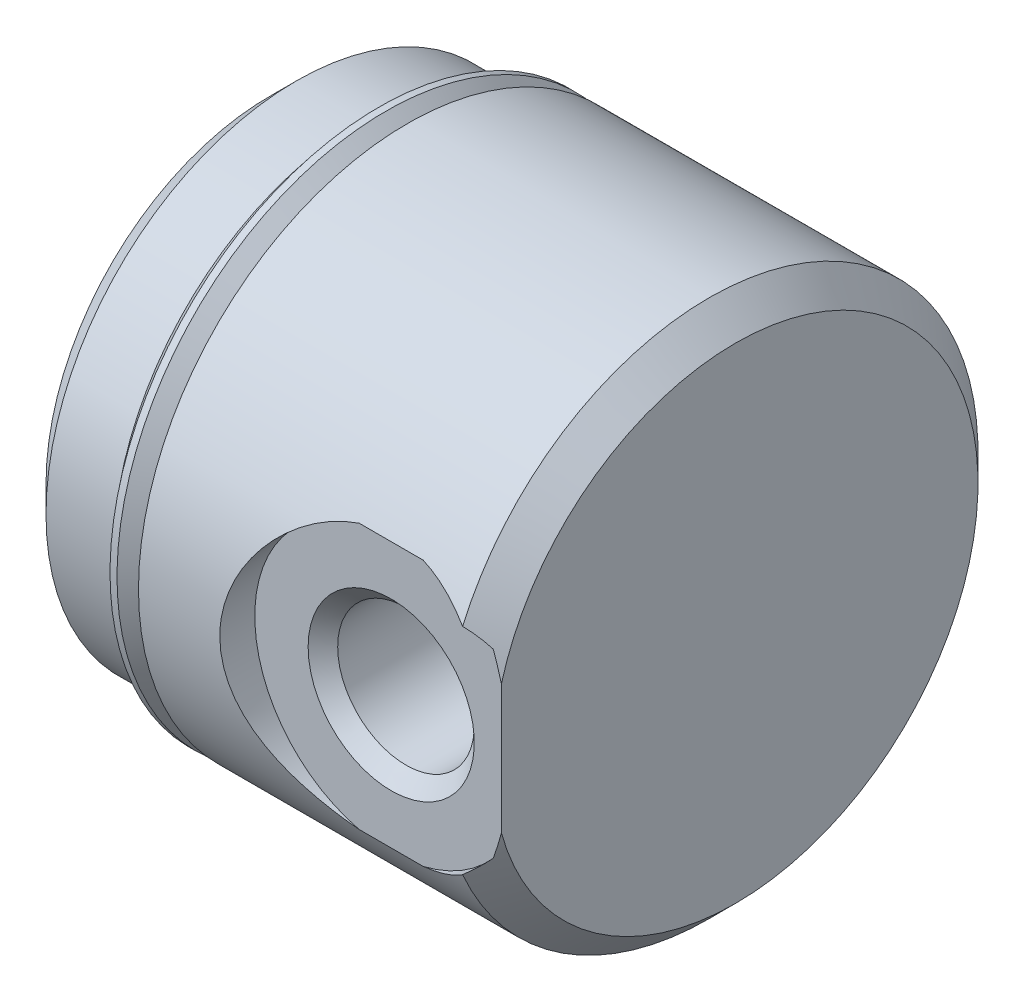
ISO-10303-21;
HEADER;
FILE_DESCRIPTION(('STEP AP214'),'2;1');
FILE_NAME('part.step','',(''),(''),'','','');
FILE_SCHEMA(('AUTOMOTIVE_DESIGN { 1 0 10303 214 1 1 1 1 }'));
ENDSEC;
DATA;
#1=APPLICATION_CONTEXT('core data for automotive mechanical design processes');
#2=APPLICATION_PROTOCOL_DEFINITION('international standard','automotive_design',2000,#1);
#3=PRODUCT_CONTEXT('',#1,'mechanical');
#4=PRODUCT('Part','Part','',(#3));
#5=PRODUCT_RELATED_PRODUCT_CATEGORY('part','',(#4));
#6=PRODUCT_DEFINITION_FORMATION('','',#4);
#7=PRODUCT_DEFINITION_CONTEXT('part definition',#1,'design');
#8=PRODUCT_DEFINITION('design','',#6,#7);
#9=PRODUCT_DEFINITION_SHAPE('','',#8);
#10=(LENGTH_UNIT() NAMED_UNIT(*) SI_UNIT(.MILLI.,.METRE.));
#11=(NAMED_UNIT(*) PLANE_ANGLE_UNIT() SI_UNIT($,.RADIAN.));
#12=(NAMED_UNIT(*) SI_UNIT($,.STERADIAN.) SOLID_ANGLE_UNIT());
#13=UNCERTAINTY_MEASURE_WITH_UNIT(LENGTH_MEASURE(1.E-05),#10,'distance_accuracy_value','');
#14=(GEOMETRIC_REPRESENTATION_CONTEXT(3) GLOBAL_UNCERTAINTY_ASSIGNED_CONTEXT((#13)) GLOBAL_UNIT_ASSIGNED_CONTEXT((#10,
#11,#12)) REPRESENTATION_CONTEXT('',''));
#15=CARTESIAN_POINT('',(0.,0.,0.));
#16=DIRECTION('',(0.,0.,1.));
#17=DIRECTION('',(1.,0.,0.));
#18=AXIS2_PLACEMENT_3D('',#15,#16,#17);
#19=CARTESIAN_POINT('',(13.5128,0.,0.));
#20=DIRECTION('',(-1.,0.,0.));
#21=DIRECTION('',(0.,0.,1.));
#22=AXIS2_PLACEMENT_3D('',#19,#20,#21);
#23=CYLINDRICAL_SURFACE('',#22,6.63575);
#24=CARTESIAN_POINT('',(3.3528,0.,0.));
#25=DIRECTION('',(-1.,0.,0.));
#26=DIRECTION('',(0.,0.,1.));
#27=AXIS2_PLACEMENT_3D('',#24,#25,#26);
#28=CIRCLE('',#27,6.63575);
#29=CARTESIAN_POINT('',(3.3528,0.,6.63575));
#30=VERTEX_POINT('',#29);
#31=EDGE_CURVE('E217',#30,#30,#28,.T.);
#32=ORIENTED_EDGE('',*,*,#31,.F.);
#33=EDGE_LOOP('',(#32));
#34=FACE_BOUND('',#33,.T.);
#35=CARTESIAN_POINT('',(3.67030000000005,0.,0.));
#36=DIRECTION('',(1.,0.,0.));
#37=DIRECTION('',(0.,1.,0.));
#38=AXIS2_PLACEMENT_3D('',#35,#36,#37);
#39=CIRCLE('',#38,6.63575);
#40=CARTESIAN_POINT('',(3.67030000000002,6.63575000000002,0.));
#41=VERTEX_POINT('',#40);
#42=EDGE_CURVE('E11',#41,#41,#39,.T.);
#43=ORIENTED_EDGE('',*,*,#42,.F.);
#44=EDGE_LOOP('',(#43));
#45=FACE_BOUND('',#44,.T.);
#46=ADVANCED_FACE('F32',(#34,#45),#23,.T.);
#47=CARTESIAN_POINT('',(13.5128,0.,0.));
#48=DIRECTION('',(-1.,0.,0.));
#49=DIRECTION('',(0.,0.,1.));
#50=AXIS2_PLACEMENT_3D('',#47,#48,#49);
#51=CYLINDRICAL_SURFACE('',#50,7.8105);
#52=CARTESIAN_POINT('',(3.9878,0.,0.));
#53=DIRECTION('',(-1.,0.,0.));
#54=DIRECTION('',(0.,0.,1.));
#55=AXIS2_PLACEMENT_3D('',#52,#53,#54);
#56=CIRCLE('',#55,7.8105);
#57=CARTESIAN_POINT('',(3.9878,0.,7.8105));
#58=VERTEX_POINT('',#57);
#59=EDGE_CURVE('E222',#58,#58,#56,.T.);
#60=ORIENTED_EDGE('',*,*,#59,.F.);
#61=EDGE_LOOP('',(#60));
#62=FACE_BOUND('',#61,.T.);
#63=CARTESIAN_POINT('',(9.38399612236914,3.85210072557819,6.7945));
#64=CARTESIAN_POINT('',(9.27525514945077,3.82589500564141,6.80934433204708));
#65=CARTESIAN_POINT('',(9.16802096495672,3.79517500586059,6.82657399668449));
#66=CARTESIAN_POINT('',(8.95724584367017,3.72511680182272,6.86506038601814));
#67=CARTESIAN_POINT('',(8.8537019230518,3.68578575285989,6.88631376526359));
#68=CARTESIAN_POINT('',(8.55020870658089,3.55577888639684,6.95484713687291));
#69=CARTESIAN_POINT('',(8.3564755421578,3.45286266206164,7.00703729481279));
#70=CARTESIAN_POINT('',(7.99051036112021,3.21817634438967,7.11786553311782));
#71=CARTESIAN_POINT('',(7.81822022256684,3.08648703832435,7.17648533571344));
#72=CARTESIAN_POINT('',(7.4971811190607,2.79677234095304,7.29427484256322));
#73=CARTESIAN_POINT('',(7.34846298374265,2.63871300579141,7.35344516154359));
#74=CARTESIAN_POINT('',(7.06940154883617,2.28841557588023,7.47015661481015));
#75=CARTESIAN_POINT('',(6.94082853392618,2.09464302317266,7.52735477020865));
#76=CARTESIAN_POINT('',(6.71863925116721,1.68511919200368,7.62946016123117));
#77=CARTESIAN_POINT('',(6.62498895097854,1.46938957321628,7.67437935130223));
#78=CARTESIAN_POINT('',(6.48499839115904,1.04670163284467,7.74267421743849));
#79=CARTESIAN_POINT('',(6.4345871592955,0.841388849692399,7.76787617373968));
#80=CARTESIAN_POINT('',(6.36709753469923,0.4240446774056,7.80178403706623));
#81=CARTESIAN_POINT('',(6.35000213276855,0.212016772858684,7.81049836168719));
#82=CARTESIAN_POINT('',(6.34999790509193,-0.208253092440596,7.8105016092298));
#83=CARTESIAN_POINT('',(6.36648759312599,-0.416495444900189,7.80209711836994));
#84=CARTESIAN_POINT('',(6.43161549719737,-0.826593665158206,7.76936300856744));
#85=CARTESIAN_POINT('',(6.48026119956296,-1.02844803428297,7.7450296812023));
#86=CARTESIAN_POINT('',(6.60730932530864,-1.41953626393276,7.68296480855789));
#87=CARTESIAN_POINT('',(6.68561430159466,-1.60880909321737,7.645277165452));
#88=CARTESIAN_POINT('',(6.86916132351943,-1.97130408916965,7.55993347529357));
#89=CARTESIAN_POINT('',(6.97440994060004,-2.14452232613126,7.51227499691478));
#90=CARTESIAN_POINT('',(7.21620525938159,-2.48190984333818,7.40790858770927));
#91=CARTESIAN_POINT('',(7.35427936201733,-2.64486639030063,7.35082425979541));
#92=CARTESIAN_POINT('',(7.65450312726616,-2.94644852490168,7.23522519139544));
#93=CARTESIAN_POINT('',(7.81667373068981,-3.08505271842146,7.17670924409722));
#94=CARTESIAN_POINT('',(8.16248595465623,-3.3352651062674,7.06390731868926));
#95=CARTESIAN_POINT('',(8.34615076465179,-3.44684373778794,7.00962601637755));
#96=CARTESIAN_POINT('',(8.63462650467648,-3.59127493866339,6.93610629540564));
#97=CARTESIAN_POINT('',(8.73286077067896,-3.63556844811676,6.91293281761722));
#98=CARTESIAN_POINT('',(8.93322584452171,-3.71619801837318,6.86992504364546));
#99=CARTESIAN_POINT('',(9.03535390798847,-3.75253956633276,6.85008844708623));
#100=CARTESIAN_POINT('',(9.17945389360375,-3.79721428881743,6.82534082601764));
#101=CARTESIAN_POINT('',(9.22006449116651,-3.80909600866532,6.81871427962771));
#102=CARTESIAN_POINT('',(9.30171232861858,-3.83156813434324,6.80611204807017));
#103=CARTESIAN_POINT('',(9.34274927489272,-3.84215937221748,6.80013594379516));
#104=CARTESIAN_POINT('',(9.38399612236914,-3.85210072557819,6.7945));
#105=B_SPLINE_CURVE_WITH_KNOTS('',3,(#63,#64,#65,#66,#67,#68,#69,#70,#71,#72,#73,#74,#75,#76,
#77,#78,#79,#80,#81,#82,#83,#84,#85,#86,#87,#88,#89,#90,#91,#92,#93,#94,#95,#96,#97,#98,#99,
#100,#101,#102,#103,#104),.UNSPECIFIED.,.F.,.F.,(4,2,2,2,2,2,2,2,2,2,2,2,2,2,2,2,2,2,2,2,4),(0.,
0.338222818675509,0.676165652849875,1.34921264078913,2.02039363276877,2.69244533968194,
3.40724108890215,4.12133843480017,4.7568840992762,5.3921052046171,6.01604998873543,
6.64014008630427,7.26219724397962,7.8844062635915,8.54490302049851,9.20597716914357,
9.86777122242373,10.1981171851282,10.5282344725933,10.6567002766156,10.7850828084272),.UNSPECIFIED.);
#106=CARTESIAN_POINT('',(9.38399612236914,3.85210072557819,6.7945));
#107=VERTEX_POINT('',#106);
#108=CARTESIAN_POINT('',(9.38399612236914,-3.85210072557819,6.7945));
#109=VERTEX_POINT('',#108);
#110=EDGE_CURVE('E174',#107,#109,#105,.T.);
#111=ORIENTED_EDGE('',*,*,#110,.F.);
#112=DIRECTION('',(-1.,0.,0.));
#113=VECTOR('',#112,1.);
#114=CARTESIAN_POINT('',(13.5128,3.85210072557819,6.7945));
#115=LINE('',#114,#113);
#116=CARTESIAN_POINT('',(11.2408038776309,3.85210072557819,6.7945));
#117=VERTEX_POINT('',#116);
#118=EDGE_CURVE('E261',#117,#107,#115,.T.);
#119=ORIENTED_EDGE('',*,*,#118,.F.);
#120=CARTESIAN_POINT('',(12.7508,3.12327059346449,7.15884704753496));
#121=CARTESIAN_POINT('',(12.6655559368567,3.1898241455409,7.12981237945193));
#122=CARTESIAN_POINT('',(12.577488456607,3.25296111612175,7.10116031336817));
#123=CARTESIAN_POINT('',(12.3960253027595,3.37207803017898,7.04537627065184));
#124=CARTESIAN_POINT('',(12.302623355752,3.42804928517144,7.01824616137133));
#125=CARTESIAN_POINT('',(12.1128109754522,3.53137242590324,6.96682057227383));
#126=CARTESIAN_POINT('',(12.01648964568,3.57886610492564,6.94248152080266));
#127=CARTESIAN_POINT('',(11.8197706894276,3.66606160853936,6.89683433759524));
#128=CARTESIAN_POINT('',(11.7193766316544,3.70577008418982,6.87552362301046));
#129=CARTESIAN_POINT('',(11.5558463074784,3.76280245035719,6.84440084379513));
#130=CARTESIAN_POINT('',(11.4938343188973,3.78273457572507,6.83339444351767));
#131=CARTESIAN_POINT('',(11.3683217162896,3.81967906487981,6.81281190797561));
#132=CARTESIAN_POINT('',(11.3048146525249,3.83667422140811,6.80324424179991));
#133=CARTESIAN_POINT('',(11.2408038776309,3.85210072557819,6.7945));
#134=B_SPLINE_CURVE_WITH_KNOTS('',3,(#120,#121,#122,#123,#124,#125,#126,#127,#128,#129,#130,
#131,#132,#133),.UNSPECIFIED.,.F.,.F.,(4,2,2,2,2,2,4),(0.,0.335875743787151,0.672154958236014,
1.00213628499122,1.33183446161207,1.52992691212799,1.72914326559982),.UNSPECIFIED.);
#135=CARTESIAN_POINT('',(12.7508,3.12327059346449,7.15884704753496));
#136=VERTEX_POINT('',#135);
#137=EDGE_CURVE('E170',#136,#117,#134,.T.);
#138=ORIENTED_EDGE('',*,*,#137,.F.);
#139=CARTESIAN_POINT('',(12.7508,0.,0.));
#140=DIRECTION('',(-1.,0.,0.));
#141=DIRECTION('',(0.,0.,1.));
#142=AXIS2_PLACEMENT_3D('',#139,#140,#141);
#143=CIRCLE('',#142,7.8105);
#144=CARTESIAN_POINT('',(12.7508,-3.12327059346449,7.15884704753496));
#145=VERTEX_POINT('',#144);
#146=EDGE_CURVE('E225',#136,#145,#143,.T.);
#147=ORIENTED_EDGE('',*,*,#146,.T.);
#148=CARTESIAN_POINT('',(11.2408038776309,-3.85210072557819,6.7945));
#149=CARTESIAN_POINT('',(11.3487874661514,-3.82608734118409,6.80923597428489));
#150=CARTESIAN_POINT('',(11.4553272931661,-3.7955949609063,6.82633875035155));
#151=CARTESIAN_POINT('',(11.6648263189775,-3.72608473219303,6.86453323045579));
#152=CARTESIAN_POINT('',(11.7677864482778,-3.68706911877762,6.88562388856926));
#153=CARTESIAN_POINT('',(11.967740110973,-3.60167827285247,6.93066373338396));
#154=CARTESIAN_POINT('',(12.0648061796481,-3.55544250400555,6.95455696361609));
#155=CARTESIAN_POINT('',(12.2543575094363,-3.4555582788781,7.00472342703105));
#156=CARTESIAN_POINT('',(12.346844503417,-3.40191265630321,7.03099574907564));
#157=CARTESIAN_POINT('',(12.4908755223305,-3.31043192739124,7.07434755482647));
#158=CARTESIAN_POINT('',(12.5440178501033,-3.27484029422275,7.09090741560835));
#159=CARTESIAN_POINT('',(12.6487074330667,-3.20100048056863,7.12454640451288));
#160=CARTESIAN_POINT('',(12.7002446852178,-3.16273916066868,7.14162782854875));
#161=CARTESIAN_POINT('',(12.7508,-3.12327059346449,7.15884704753496));
#162=B_SPLINE_CURVE_WITH_KNOTS('',3,(#148,#149,#150,#151,#152,#153,#154,#155,#156,#157,#158,
#159,#160,#161),.UNSPECIFIED.,.F.,.F.,(4,2,2,2,2,2,4),(0.,0.33595843839208,0.671828885004199,
1.00187083479376,1.33178691629107,1.52992689818495,1.72912219497278),.UNSPECIFIED.);
#163=CARTESIAN_POINT('',(11.2408038776309,-3.85210072557819,6.7945));
#164=VERTEX_POINT('',#163);
#165=EDGE_CURVE('E164',#164,#145,#162,.T.);
#166=ORIENTED_EDGE('',*,*,#165,.F.);
#167=DIRECTION('',(-1.,0.,0.));
#168=VECTOR('',#167,1.);
#169=CARTESIAN_POINT('',(13.5128,-3.85210072557819,6.7945));
#170=LINE('',#169,#168);
#171=EDGE_CURVE('E268',#109,#164,#170,.F.);
#172=ORIENTED_EDGE('',*,*,#171,.F.);
#173=EDGE_LOOP('',(#111,#119,#138,#147,#166,#172));
#174=FACE_BOUND('',#173,.T.);
#175=ADVANCED_FACE('F179',(#62,#174),#51,.T.);
#176=CARTESIAN_POINT('',(13.5128,0.,0.));
#177=DIRECTION('',(-1.,0.,0.));
#178=DIRECTION('',(0.,0.,1.));
#179=AXIS2_PLACEMENT_3D('',#176,#177,#178);
#180=CONICAL_SURFACE('',#179,7.0485,0.785398163397448);
#181=CARTESIAN_POINT('',(9.49140746056933,-8.7394101966061,6.7945));
#182=CARTESIAN_POINT('',(9.64426579725967,-8.54575700662644,6.7945));
#183=CARTESIAN_POINT('',(9.79598137394143,-8.35119045289017,6.7945));
#184=CARTESIAN_POINT('',(10.0966409028078,-7.9598804254788,6.7945));
#185=CARTESIAN_POINT('',(10.2455844132447,-7.76313661267479,6.7945));
#186=CARTESIAN_POINT('',(10.5408614306149,-7.36624688277227,6.7945));
#187=CARTESIAN_POINT('',(10.6871792688678,-7.16608927887687,6.7945));
#188=CARTESIAN_POINT('',(10.9757819818662,-6.76289558199411,6.7945));
#189=CARTESIAN_POINT('',(11.1180670497523,-6.55985962755991,6.7945));
#190=CARTESIAN_POINT('',(11.4044051028073,-6.14068708368496,6.7945));
#191=CARTESIAN_POINT('',(11.5482196702436,-5.92438703356951,6.7945));
#192=CARTESIAN_POINT('',(11.8292052349774,-5.4874628667435,6.7945));
#193=CARTESIAN_POINT('',(11.9663755397359,-5.26683830263595,6.7945));
#194=CARTESIAN_POINT('',(12.2321205727388,-4.82099454058223,6.7945));
#195=CARTESIAN_POINT('',(12.3607106557173,-4.59578454589868,6.7945));
#196=CARTESIAN_POINT('',(12.6073393962508,-4.13969271797501,6.7945));
#197=CARTESIAN_POINT('',(12.7253810470873,-3.90881251760282,6.7945));
#198=CARTESIAN_POINT('',(12.9371220333846,-3.46371027077012,6.7945));
#199=CARTESIAN_POINT('',(13.0320738511881,-3.25008835450491,6.7945));
#200=CARTESIAN_POINT('',(13.2085293963946,-2.81727568340665,6.7945));
#201=CARTESIAN_POINT('',(13.2900318624374,-2.59808440846811,6.7945));
#202=CARTESIAN_POINT('',(13.4357616210469,-2.15661042486929,6.7945));
#203=CARTESIAN_POINT('',(13.5001675962105,-1.93438748873129,6.7945));
#204=CARTESIAN_POINT('',(13.6097759823049,-1.48520590811597,6.7945));
#205=CARTESIAN_POINT('',(13.6549806063305,-1.25824781256518,6.7945));
#206=CARTESIAN_POINT('',(13.7241449876086,-0.796547614716598,6.7945));
#207=CARTESIAN_POINT('',(13.7476760881768,-0.561739898219707,6.7945));
#208=CARTESIAN_POINT('',(13.7702581670218,-0.0909537779366904,6.7945));
#209=CARTESIAN_POINT('',(13.7693120025898,0.145024485993293,6.7945));
#210=CARTESIAN_POINT('',(13.742985746537,0.616163272173993,6.7945));
#211=CARTESIAN_POINT('',(13.7175462370887,0.851320409945158,6.7945));
#212=CARTESIAN_POINT('',(13.6439837210982,1.31804072771941,6.7945));
#213=CARTESIAN_POINT('',(13.595854580662,1.54960291837184,6.7945));
#214=CARTESIAN_POINT('',(13.464002121112,2.07027394210681,6.7945));
#215=CARTESIAN_POINT('',(13.3741460328673,2.35781582332683,6.7945));
#216=CARTESIAN_POINT('',(13.1691787635715,2.92369387323482,6.7945));
#217=CARTESIAN_POINT('',(13.0540535940133,3.20202484433047,6.7945));
#218=CARTESIAN_POINT('',(12.8035779245321,3.75199167165985,6.7945));
#219=CARTESIAN_POINT('',(12.6680734656556,4.02355644203065,6.7945));
#220=CARTESIAN_POINT('',(12.3823369857443,4.55865515554981,6.7945));
#221=CARTESIAN_POINT('',(12.2321080764981,4.82219078017014,6.7945));
#222=CARTESIAN_POINT('',(11.8819470844149,5.40680573244951,6.7945));
#223=CARTESIAN_POINT('',(11.6789065439073,5.72601168566491,6.7945));
#224=CARTESIAN_POINT('',(11.2602256462692,6.35610652786929,6.7945));
#225=CARTESIAN_POINT('',(11.0445813596588,6.66699277850116,6.7945));
#226=CARTESIAN_POINT('',(10.609518806143,7.27436997752772,6.7945));
#227=CARTESIAN_POINT('',(10.3903305676446,7.5710264323084,6.7945));
#228=CARTESIAN_POINT('',(10.0565997126367,8.01203315805542,6.7945));
#229=CARTESIAN_POINT('',(9.94458282461457,8.15830752655089,6.7945));
#230=CARTESIAN_POINT('',(9.71906341788757,8.44969582633714,6.7945));
#231=CARTESIAN_POINT('',(9.6055609703792,8.59480981270698,6.7945));
#232=CARTESIAN_POINT('',(9.49140746056933,8.7394101966061,6.7945));
#233=B_SPLINE_CURVE_WITH_KNOTS('',3,(#181,#182,#183,#184,#185,#186,#187,#188,#189,#190,#191,
#192,#193,#194,#195,#196,#197,#198,#199,#200,#201,#202,#203,#204,#205,#206,#207,#208,#209,#210,
#211,#212,#213,#214,#215,#216,#217,#218,#219,#220,#221,#222,#223,#224,#225,#226,#227,#228,#229,
#230,#231,#232),.UNSPECIFIED.,.F.,.F.,(4,2,2,2,2,2,2,2,2,2,2,2,2,2,2,2,2,2,2,2,2,2,2,2,2,4),(0.,
0.740147440544245,1.48041183582862,2.22417603592427,2.96790455471248,3.74704634345077,
4.52626916904978,5.30405790904193,6.08162523385951,6.78257788043754,7.48359622920699,
8.17697046937258,8.87026477144101,9.57699370060748,10.2836401319507,10.9920051306815,
11.7005617380673,12.6027504407288,13.5054398440798,14.4153274088645,15.3250230956728,
16.4595215698103,17.5943756539681,18.7007881879111,19.2534976174719,19.8061806543341),.UNSPECIFIED.);
#234=CARTESIAN_POINT('',(13.5128,1.87513252864964,6.7945));
#235=VERTEX_POINT('',#234);
#236=CARTESIAN_POINT('',(13.2751529346136,2.63110410444708,6.7945));
#237=VERTEX_POINT('',#236);
#238=EDGE_CURVE('E111',#235,#237,#233,.T.);
#239=ORIENTED_EDGE('',*,*,#238,.F.);
#240=CARTESIAN_POINT('',(13.5128,0.,0.));
#241=DIRECTION('',(-1.,0.,0.));
#242=DIRECTION('',(0.,0.,1.));
#243=AXIS2_PLACEMENT_3D('',#240,#241,#242);
#244=CIRCLE('',#243,7.0485);
#245=CARTESIAN_POINT('',(13.5128,-1.87513252864964,6.7945));
#246=VERTEX_POINT('',#245);
#247=EDGE_CURVE('E228',#235,#246,#244,.T.);
#248=ORIENTED_EDGE('',*,*,#247,.T.);
#249=CARTESIAN_POINT('',(13.2751529346136,-2.63110410444708,6.7945));
#250=VERTEX_POINT('',#249);
#251=EDGE_CURVE('E47',#250,#246,#233,.T.);
#252=ORIENTED_EDGE('',*,*,#251,.F.);
#253=CARTESIAN_POINT('',(12.6744,-3.18144145946456,7.21675978885261));
#254=CARTESIAN_POINT('',(12.7428462942749,-3.13063101730477,7.16433883739875));
#255=CARTESIAN_POINT('',(12.8106286002932,-3.07687381670484,7.11384472463599));
#256=CARTESIAN_POINT('',(12.9437902999926,-2.96377725375633,7.0173804234194));
#257=CARTESIAN_POINT('',(13.0091819939163,-2.90447459819277,6.97138410832151));
#258=CARTESIAN_POINT('',(13.1373601067734,-2.77996198064994,6.8839214095247));
#259=CARTESIAN_POINT('',(13.2001462436358,-2.71475138151159,6.84245551548834));
#260=CARTESIAN_POINT('',(13.3227431146446,-2.5781681959087,6.76403383783796));
#261=CARTESIAN_POINT('',(13.3825328244488,-2.50675967916862,6.7271078293995));
#262=CARTESIAN_POINT('',(13.4402439490976,-2.43253077885839,6.6927));
#263=B_SPLINE_CURVE_WITH_KNOTS('',3,(#253,#254,#255,#256,#257,#258,#259,#260,#261,#262),
.UNSPECIFIED.,.F.,.F.,(4,2,2,2,4),(0.,0.300202802782513,0.598542861090956,0.896915133125371,
1.19715028692185),.UNSPECIFIED.);
#264=EDGE_CURVE('E123',#145,#250,#263,.T.);
#265=ORIENTED_EDGE('',*,*,#264,.F.);
#266=ORIENTED_EDGE('',*,*,#146,.F.);
#267=CARTESIAN_POINT('',(13.4402439490975,2.43253077885853,6.69270000000006));
#268=CARTESIAN_POINT('',(13.3825328244487,2.50675967916874,6.72710782939955));
#269=CARTESIAN_POINT('',(13.3227431146445,2.57816819590881,6.76403383783801));
#270=CARTESIAN_POINT('',(13.2001462436357,2.71475138151167,6.84245551548839));
#271=CARTESIAN_POINT('',(13.1373601067733,2.77996198065001,6.88392140952474));
#272=CARTESIAN_POINT('',(13.0091819939162,2.90447459819281,6.97138410832155));
#273=CARTESIAN_POINT('',(12.9437902999926,2.96377725375636,7.01738042341943));
#274=CARTESIAN_POINT('',(12.8106286002932,3.07687381670485,7.113844724636));
#275=CARTESIAN_POINT('',(12.7428462942749,3.13063101730478,7.16433883739876));
#276=CARTESIAN_POINT('',(12.6744,3.18144145946456,7.21675978885261));
#277=B_SPLINE_CURVE_WITH_KNOTS('',3,(#267,#268,#269,#270,#271,#272,#273,#274,#275,#276),
.UNSPECIFIED.,.F.,.F.,(4,2,2,2,4),(0.,0.300235153796429,0.5986074258308,0.896947484139196,
1.19715028692166),.UNSPECIFIED.);
#278=EDGE_CURVE('E135',#237,#136,#277,.T.);
#279=ORIENTED_EDGE('',*,*,#278,.F.);
#280=EDGE_LOOP('',(#239,#248,#252,#265,#266,#279));
#281=FACE_BOUND('',#280,.T.);
#282=ADVANCED_FACE('F140',(#281),#180,.T.);
#283=CARTESIAN_POINT('',(13.5128,7.0485,0.));
#284=DIRECTION('',(-1.,0.,0.));
#285=DIRECTION('',(0.,0.,1.));
#286=AXIS2_PLACEMENT_3D('',#283,#284,#285);
#287=PLANE('',#286);
#288=DIRECTION('',(0.,1.,0.));
#289=VECTOR('',#288,1.);
#290=CARTESIAN_POINT('',(13.5128,7.0485,6.7945));
#291=LINE('',#290,#289);
#292=EDGE_CURVE('E120',#246,#235,#291,.T.);
#293=ORIENTED_EDGE('',*,*,#292,.F.);
#294=ORIENTED_EDGE('',*,*,#247,.F.);
#295=EDGE_LOOP('',(#293,#294));
#296=FACE_BOUND('',#295,.T.);
#297=ADVANCED_FACE('F314',(#296),#287,.F.);
#298=CARTESIAN_POINT('',(13.422781656481,0.,0.));
#299=DIRECTION('',(-1.,0.,0.));
#300=DIRECTION('',(0.,0.,1.));
#301=AXIS2_PLACEMENT_3D('',#298,#299,#300);
#302=CYLINDRICAL_SURFACE('',#301,1.9558);
#303=CARTESIAN_POINT('',(0.,0.,0.));
#304=DIRECTION('',(-1.,0.,0.));
#305=DIRECTION('',(0.,0.,1.));
#306=AXIS2_PLACEMENT_3D('',#303,#304,#305);
#307=CIRCLE('',#306,1.9558);
#308=CARTESIAN_POINT('',(0.,0.,1.9558));
#309=VERTEX_POINT('',#308);
#310=EDGE_CURVE('E231',#309,#309,#307,.T.);
#311=ORIENTED_EDGE('',*,*,#310,.T.);
#312=EDGE_LOOP('',(#311));
#313=FACE_BOUND('',#312,.T.);
#314=CARTESIAN_POINT('',(12.2936,0.,0.));
#315=DIRECTION('',(-1.,0.,0.));
#316=DIRECTION('',(0.,0.,1.));
#317=AXIS2_PLACEMENT_3D('',#314,#315,#316);
#318=CIRCLE('',#317,1.9558);
#319=CARTESIAN_POINT('',(12.2936,0.100354111026915,1.95322366676221));
#320=VERTEX_POINT('',#319);
#321=CARTESIAN_POINT('',(12.2936,-0.100354111026915,1.95322366676221));
#322=VERTEX_POINT('',#321);
#323=EDGE_CURVE('E234',#320,#322,#318,.T.);
#324=ORIENTED_EDGE('',*,*,#323,.F.);
#325=CARTESIAN_POINT('',(12.2936,0.100354111026915,1.95322366676221));
#326=CARTESIAN_POINT('',(12.2913111971006,0.145764182577558,1.95090186509851));
#327=CARTESIAN_POINT('',(12.2874438538481,0.190998100157405,1.94697922404948));
#328=CARTESIAN_POINT('',(12.2766973581199,0.280688652821852,1.93607707137792));
#329=CARTESIAN_POINT('',(12.269821270642,0.325146031161171,1.92910067060772));
#330=CARTESIAN_POINT('',(12.2532724227323,0.41255576459903,1.91230671868573));
#331=CARTESIAN_POINT('',(12.2436254878819,0.455518087592471,1.90251540309953));
#332=CARTESIAN_POINT('',(12.2217119161094,0.540057123069125,1.88026724477264));
#333=CARTESIAN_POINT('',(12.2094447230826,0.581633539248586,1.86780983619838));
#334=CARTESIAN_POINT('',(12.169142358704,0.70358047274614,1.8268674830365));
#335=CARTESIAN_POINT('',(12.1375238266824,0.781588381265155,1.79472869898898));
#336=CARTESIAN_POINT('',(12.0665286563751,0.930091894590893,1.72248118197103));
#337=CARTESIAN_POINT('',(12.0271337638455,1.00056921031692,1.68235369436989));
#338=CARTESIAN_POINT('',(11.9227539046494,1.16414838494933,1.57585769577419));
#339=CARTESIAN_POINT('',(11.8543360436536,1.25273431315264,1.50591187652808));
#340=CARTESIAN_POINT('',(11.7087370069774,1.41324566546971,1.35645874616463));
#341=CARTESIAN_POINT('',(11.6315319449347,1.48512398007586,1.27692533655788));
#342=CARTESIAN_POINT('',(11.4972277991784,1.59256258820995,1.13752819692645));
#343=CARTESIAN_POINT('',(11.4415727358037,1.63239347507645,1.07948469137479));
#344=CARTESIAN_POINT('',(11.328546865222,1.70504586591522,0.96064109274795));
#345=CARTESIAN_POINT('',(11.2711748389865,1.73786224826704,0.899839024516364));
#346=CARTESIAN_POINT('',(11.1558928554175,1.79664319121424,0.775835734347148));
#347=CARTESIAN_POINT('',(11.0979845242145,1.82262404527656,0.712640635923184));
#348=CARTESIAN_POINT('',(10.9828468960121,1.86802226112202,0.583408872225342));
#349=CARTESIAN_POINT('',(10.9256168903309,1.88744718874871,0.517375582301224));
#350=CARTESIAN_POINT('',(10.844471378011,1.91124966305318,0.416388330856548));
#351=CARTESIAN_POINT('',(10.8188786859447,1.91816530063261,0.383373698827901));
#352=CARTESIAN_POINT('',(10.7696324810795,1.93049138855675,0.315522766407918));
#353=CARTESIAN_POINT('',(10.7459813794606,1.93589998673719,0.280684286380416));
#354=CARTESIAN_POINT('',(10.7107602671575,1.9433821128032,0.221273686525073));
#355=CARTESIAN_POINT('',(10.6979119486395,1.94595466370079,0.197537773460835));
#356=CARTESIAN_POINT('',(10.6753176594999,1.9502936222708,0.148675894469281));
#357=CARTESIAN_POINT('',(10.6655500025059,1.95206570490619,0.123561176609244));
#358=CARTESIAN_POINT('',(10.6538049796752,1.9541468195226,0.0819214900082894));
#359=CARTESIAN_POINT('',(10.6502751087409,1.95475688516644,0.0658634497317409));
#360=CARTESIAN_POINT('',(10.6454207965356,1.9555878763089,0.0332251392414867));
#361=CARTESIAN_POINT('',(10.6441224317973,1.95580420241734,0.0166409707163111));
#362=CARTESIAN_POINT('',(10.6441691179119,1.9558,0.));
#363=B_SPLINE_CURVE_WITH_KNOTS('',3,(#325,#326,#327,#328,#329,#330,#331,#332,#333,#334,#335,
#336,#337,#338,#339,#340,#341,#342,#343,#344,#345,#346,#347,#348,#349,#350,#351,#352,#353,#354,
#355,#356,#357,#358,#359,#360,#361,#362),.UNSPECIFIED.,.F.,.F.,(4,2,2,2,2,2,2,2,2,2,2,2,2,2,2,2,
2,2,4),(0.,0.136504065660945,0.272869397642684,0.408002839823062,0.543164990303602,
0.812198889136187,1.08187199418894,1.47565999165441,1.87054521464505,2.1394435887731,
2.40853763264522,2.67698431855941,2.94512013665316,3.07209625867962,3.19922775395246,
3.28044619269889,3.36107942647211,3.41028783606703,3.46006746269593),.UNSPECIFIED.);
#364=CARTESIAN_POINT('',(10.6441691179118,1.9558,0.));
#365=VERTEX_POINT('',#364);
#366=EDGE_CURVE('E55',#320,#365,#363,.T.);
#367=ORIENTED_EDGE('',*,*,#366,.T.);
#368=DIRECTION('',(-1.,0.,0.));
#369=VECTOR('',#368,1.);
#370=CARTESIAN_POINT('',(13.422781656481,1.9558,0.));
#371=LINE('',#370,#369);
#372=CARTESIAN_POINT('',(9.98063088208815,1.9558,0.));
#373=VERTEX_POINT('',#372);
#374=EDGE_CURVE('E115',#365,#373,#371,.T.);
#375=ORIENTED_EDGE('',*,*,#374,.T.);
#376=CARTESIAN_POINT('',(9.98063088208815,1.9558,0.));
#377=CARTESIAN_POINT('',(9.9807964864296,1.95581373301302,0.0259769161206502));
#378=CARTESIAN_POINT('',(9.9775814806674,1.95528513792881,0.0515879757271484));
#379=CARTESIAN_POINT('',(9.9663469522186,1.95333491975591,0.101072285749773));
#380=CARTESIAN_POINT('',(9.95845121409554,1.95193626054594,0.12497312466037));
#381=CARTESIAN_POINT('',(9.92847051749634,1.94633480434201,0.198928073204073));
#382=CARTESIAN_POINT('',(9.90066785955558,1.94077416948316,0.246350205807842));
#383=CARTESIAN_POINT('',(9.83975480166569,1.92688366781499,0.338318369880022));
#384=CARTESIAN_POINT('',(9.80653506850994,1.9184918229404,0.382770681138122));
#385=CARTESIAN_POINT('',(9.71746544516624,1.89327580617336,0.495733084768364));
#386=CARTESIAN_POINT('',(9.66005025276408,1.87441845498131,0.562583896477993));
#387=CARTESIAN_POINT('',(9.54433321984269,1.83008078329878,0.693322096061798));
#388=CARTESIAN_POINT('',(9.48603017992599,1.8045905835624,0.757204894543086));
#389=CARTESIAN_POINT('',(9.37048845127477,1.74703988763392,0.881860660613962));
#390=CARTESIAN_POINT('',(9.31324492517865,1.71503735432669,0.942655525215075));
#391=CARTESIAN_POINT('',(9.20038124922469,1.64410578354054,1.06153307609799));
#392=CARTESIAN_POINT('',(9.14475977108673,1.60518260992286,1.11961800631828));
#393=CARTESIAN_POINT('',(9.01182616334868,1.50122277369766,1.25774350188289));
#394=CARTESIAN_POINT('',(8.93580171160119,1.43225070716075,1.3361316499877));
#395=CARTESIAN_POINT('',(8.7916956781078,1.27819854398065,1.48416610560746));
#396=CARTESIAN_POINT('',(8.72361182130342,1.19312307953287,1.55381491746413));
#397=CARTESIAN_POINT('',(8.61415812116012,1.02882382498211,1.6655473542454));
#398=CARTESIAN_POINT('',(8.5702916738039,0.953055262330239,1.71024160456384));
#399=CARTESIAN_POINT('',(8.49161659704261,0.792424659811757,1.79031756278731));
#400=CARTESIAN_POINT('',(8.45679488251467,0.70757601017374,1.82571272465473));
#401=CARTESIAN_POINT('',(8.40313267978378,0.544161895937165,1.88022605331359));
#402=CARTESIAN_POINT('',(8.38264022581813,0.466706395508032,1.90102851495333));
#403=CARTESIAN_POINT('',(8.3510468817919,0.307979363729486,1.93309153403101));
#404=CARTESIAN_POINT('',(8.33994067036128,0.226710022196422,1.94435749802938));
#405=CARTESIAN_POINT('',(8.32792580612236,0.0623828489978677,1.95654495131));
#406=CARTESIAN_POINT('',(8.32704837925985,-0.02067968408246,1.95743476477705));
#407=CARTESIAN_POINT('',(8.33564318875725,-0.185704240381119,1.94871682426055));
#408=CARTESIAN_POINT('',(8.34511645073471,-0.26766615372779,1.93910803000264));
#409=CARTESIAN_POINT('',(8.37302603907796,-0.42438705064564,1.9107867647994));
#410=CARTESIAN_POINT('',(8.39103327139091,-0.499304040278118,1.89251009223326));
#411=CARTESIAN_POINT('',(8.4347146717612,-0.644418404776665,1.84814674055603));
#412=CARTESIAN_POINT('',(8.4603928698934,-0.714613274986688,1.82205595614739));
#413=CARTESIAN_POINT('',(8.52947440318664,-0.875662732553986,1.7518015641155));
#414=CARTESIAN_POINT('',(8.57588393763709,-0.96388396084713,1.70455890341169));
#415=CARTESIAN_POINT('',(8.67797875508301,-1.12840648261461,1.60042753259564));
#416=CARTESIAN_POINT('',(8.73367585545847,-1.20469234689281,1.54352653166071));
#417=CARTESIAN_POINT('',(8.83312983285738,-1.32323225141215,1.44161398491157));
#418=CARTESIAN_POINT('',(8.87513617334873,-1.36864582558287,1.39848790565577));
#419=CARTESIAN_POINT('',(8.96164123453572,-1.45408823511784,1.30942401779617));
#420=CARTESIAN_POINT('',(9.00614133160403,-1.49411405453863,1.26348465514013));
#421=CARTESIAN_POINT('',(9.0972602148704,-1.5691272818834,1.16903814770958));
#422=CARTESIAN_POINT('',(9.14388893948886,-1.60408699652864,1.12051873544549));
#423=CARTESIAN_POINT('',(9.23846981235048,-1.66888639186431,1.02150361769532));
#424=CARTESIAN_POINT('',(9.2864208441531,-1.69873024704181,0.971009565217951));
#425=CARTESIAN_POINT('',(9.38493440317354,-1.7545225768843,0.866288543535784));
#426=CARTESIAN_POINT('',(9.43552797876911,-1.78028651082068,0.811992582772538));
#427=CARTESIAN_POINT('',(9.53697463293319,-1.82676366046634,0.701217133829236));
#428=CARTESIAN_POINT('',(9.58782803945875,-1.84746215462259,0.644731821195712));
#429=CARTESIAN_POINT('',(9.68801183404018,-1.88365095204907,0.529750783601488));
#430=CARTESIAN_POINT('',(9.73735214769072,-1.89918926963304,0.471279514930404));
#431=CARTESIAN_POINT('',(9.80800013014298,-1.91869954735854,0.380383179707955));
#432=CARTESIAN_POINT('',(9.83093676336289,-1.92456032364857,0.349632287147622));
#433=CARTESIAN_POINT('',(9.87467938583689,-1.93497315020657,0.286461972008133));
#434=CARTESIAN_POINT('',(9.89548969583913,-1.93952788984874,0.254046142635001));
#435=CARTESIAN_POINT('',(9.92648162468823,-1.94588100673775,0.197999761618983));
#436=CARTESIAN_POINT('',(9.93787820568893,-1.9480906750665,0.17510341463161));
#437=CARTESIAN_POINT('',(9.95741004323382,-1.9517439574429,0.128054137154102));
#438=CARTESIAN_POINT('',(9.9655745724975,-1.95319448758605,0.103914833537285));
#439=CARTESIAN_POINT('',(9.97430185326276,-1.9547184304349,0.0662980512025732));
#440=CARTESIAN_POINT('',(9.97663264447576,-1.95511867496124,0.053248326589627));
#441=CARTESIAN_POINT('',(9.97981722067908,-1.95566201500794,0.0268080769542905));
#442=CARTESIAN_POINT('',(9.98065287687869,-1.95580195508375,0.0134153402698058));
#443=CARTESIAN_POINT('',(9.98063088208815,-1.9558,0.));
#444=B_SPLINE_CURVE_WITH_KNOTS('',3,(#376,#377,#378,#379,#380,#381,#382,#383,#384,#385,#386,
#387,#388,#389,#390,#391,#392,#393,#394,#395,#396,#397,#398,#399,#400,#401,#402,#403,#404,#405,
#406,#407,#408,#409,#410,#411,#412,#413,#414,#415,#416,#417,#418,#419,#420,#421,#422,#423,#424,
#425,#426,#427,#428,#429,#430,#431,#432,#433,#434,#435,#436,#437,#438,#439,#440,#441,#442,#443),
.UNSPECIFIED.,.F.,.F.,(4,2,2,2,2,2,2,2,2,2,2,2,2,2,2,2,2,2,2,2,2,2,2,2,2,2,2,2,2,2,2,2,2,4),(0.,
0.0771587508540542,0.152362707487694,0.316834666108779,0.485169877870249,0.755027524053441,
1.02528943153331,1.29324355261259,1.56097170869186,1.94711858473365,2.33315455269474,
2.62699246282701,2.92040287617489,3.16767601601427,3.41480887434566,3.66269597122577,
3.91060763269436,4.14719736895238,4.38391162097904,4.71304161831765,5.04259363743207,
5.26854833188711,5.49462898929734,5.72190230144501,5.94898926895398,6.18446190789424,
6.4206109773245,6.65449678267569,6.77086905685343,6.88699994898283,6.96387581746386,
7.04003855304326,7.07974243679728,7.1199245562875),.UNSPECIFIED.);
#445=CARTESIAN_POINT('',(9.98063088208815,-1.9558,0.));
#446=VERTEX_POINT('',#445);
#447=EDGE_CURVE('E101',#373,#446,#444,.T.);
#448=ORIENTED_EDGE('',*,*,#447,.T.);
#449=DIRECTION('',(-1.,0.,0.));
#450=VECTOR('',#449,1.);
#451=CARTESIAN_POINT('',(13.422781656481,-1.9558,0.));
#452=LINE('',#451,#450);
#453=CARTESIAN_POINT('',(10.6441691179118,-1.9558,0.));
#454=VERTEX_POINT('',#453);
#455=EDGE_CURVE('E121',#446,#454,#452,.F.);
#456=ORIENTED_EDGE('',*,*,#455,.T.);
#457=CARTESIAN_POINT('',(10.6441691179118,-1.9558,0.));
#458=CARTESIAN_POINT('',(10.6440035136748,-1.9558137330234,0.0259768852833947));
#459=CARTESIAN_POINT('',(10.6472185118086,-1.95528513917995,0.0515879152634878));
#460=CARTESIAN_POINT('',(10.6584530289537,-1.9533349231031,0.101072227963563));
#461=CARTESIAN_POINT('',(10.6663487747789,-1.951936262633,0.12497309661157));
#462=CARTESIAN_POINT('',(10.6963295094177,-1.9463347992951,0.198928140917176));
#463=CARTESIAN_POINT('',(10.7241322124614,-1.9407741550031,0.246350332322012));
#464=CARTESIAN_POINT('',(10.7850452860588,-1.92688364571825,0.338318485182379));
#465=CARTESIAN_POINT('',(10.8182649772889,-1.91849180967053,0.382770737087577));
#466=CARTESIAN_POINT('',(10.9073352541748,-1.89327560867409,0.495733975128885));
#467=CARTESIAN_POINT('',(10.9647512081615,-1.87441797762397,0.562585609414091));
#468=CARTESIAN_POINT('',(11.0804697609503,-1.83007955756081,0.693325406648934));
#469=CARTESIAN_POINT('',(11.1387735592059,-1.80458888844567,0.757208979856029));
#470=CARTESIAN_POINT('',(11.2543152568793,-1.74703787508797,0.881864609621917));
#471=CARTESIAN_POINT('',(11.3115580085715,-1.71503566719593,0.942658629038535));
#472=CARTESIAN_POINT('',(11.4244202178276,-1.64410470487024,1.06153460799563));
#473=CARTESIAN_POINT('',(11.4800410038508,-1.60518181546591,1.11961881179872));
#474=CARTESIAN_POINT('',(11.6129596689335,-1.50123412518436,1.2577287804281));
#475=CARTESIAN_POINT('',(11.6889706050857,-1.43227699062333,1.33610310052117));
#476=CARTESIAN_POINT('',(11.8330802081514,-1.27822762538741,1.4841414426289));
#477=CARTESIAN_POINT('',(11.9011783114562,-1.19313424650815,1.5538048442163));
#478=CARTESIAN_POINT('',(12.010686815762,-1.02875914719823,1.66559322715899));
#479=CARTESIAN_POINT('',(12.0545902160815,-0.952922289711566,1.71032503823108));
#480=CARTESIAN_POINT('',(12.1332547752994,-0.792244827664513,1.79039012022468));
#481=CARTESIAN_POINT('',(12.1680464374252,-0.707435634088471,1.82575475414738));
#482=CARTESIAN_POINT('',(12.21043674333,-0.578368320789924,1.86881732559349));
#483=CARTESIAN_POINT('',(12.2225508083112,-0.537058377105218,1.88111906210222));
#484=CARTESIAN_POINT('',(12.2441919202443,-0.453079806506403,1.90309035851384));
#485=CARTESIAN_POINT('',(12.25371966618,-0.410411550182515,1.91276062960354));
#486=CARTESIAN_POINT('',(12.2700708874795,-0.323598215217474,1.92935393768963));
#487=CARTESIAN_POINT('',(12.2768678923254,-0.279442976062589,1.93625008441697));
#488=CARTESIAN_POINT('',(12.2874974412642,-0.190368219734531,1.94703358108689));
#489=CARTESIAN_POINT('',(12.2913268526685,-0.145447945930763,1.95091775149157));
#490=CARTESIAN_POINT('',(12.2936,-0.100354111026915,1.95322366676221));
#491=B_SPLINE_CURVE_WITH_KNOTS('',3,(#457,#458,#459,#460,#461,#462,#463,#464,#465,#466,#467,
#468,#469,#470,#471,#472,#473,#474,#475,#476,#477,#478,#479,#480,#481,#482,#483,#484,#485,#486,
#487,#488,#489,#490),.UNSPECIFIED.,.F.,.F.,(4,2,2,2,2,2,2,2,2,2,2,2,2,2,2,2,4),(0.,
0.0771586607004265,0.152362707669762,0.316834884500356,0.485169877532191,0.755030974797278,
1.02529636212646,1.29324703799721,1.56097170829777,1.94704936614291,2.33315450637459,
2.62727754715197,2.92040299300247,3.05458048581296,3.18872167936104,3.32413349778723,
3.45968806737005),.UNSPECIFIED.);
#492=EDGE_CURVE('E116',#454,#322,#491,.T.);
#493=ORIENTED_EDGE('',*,*,#492,.T.);
#494=EDGE_LOOP('',(#324,#367,#375,#448,#456,#493));
#495=FACE_BOUND('',#494,.T.);
#496=ADVANCED_FACE('F119',(#313,#495),#302,.F.);
#497=CARTESIAN_POINT('',(13.422781656481,0.,0.));
#498=DIRECTION('',(-1.,0.,0.));
#499=DIRECTION('',(0.,0.,1.));
#500=AXIS2_PLACEMENT_3D('',#497,#498,#499);
#501=CONICAL_SURFACE('',#500,0.,1.04719755119662);
#502=CARTESIAN_POINT('',(13.422781656481,0.,0.));
#503=VERTEX_POINT('',#502);
#504=VERTEX_LOOP('',#503);
#505=FACE_BOUND('',#504,.T.);
#506=ORIENTED_EDGE('',*,*,#323,.T.);
#507=CARTESIAN_POINT('',(12.2936,-0.100354111026916,1.95322366676221));
#508=CARTESIAN_POINT('',(12.2940231387705,-0.0920018377134808,1.95291897232499));
#509=CARTESIAN_POINT('',(12.294393619082,-0.0836454978982505,1.95265250143593));
#510=CARTESIAN_POINT('',(12.2950286791185,-0.0669320256683531,1.95219618256561));
#511=CARTESIAN_POINT('',(12.2952933259754,-0.0585748971302028,1.95200628601131));
#512=CARTESIAN_POINT('',(12.2957167341546,-0.0418541952693243,1.95170286132264));
#513=CARTESIAN_POINT('',(12.2958754653767,-0.0334906207902123,1.95158935489752));
#514=CARTESIAN_POINT('',(12.2960871621835,-0.0167513658319183,1.95143817390721));
#515=CARTESIAN_POINT('',(12.29614,-0.00837568291595938,1.95140059094877));
#516=CARTESIAN_POINT('',(12.29614,0.00837568291595843,1.95140059094877));
#517=CARTESIAN_POINT('',(12.2960871621835,0.0167513658319173,1.95143817390721));
#518=CARTESIAN_POINT('',(12.2958754653767,0.0334906207902114,1.95158935489752));
#519=CARTESIAN_POINT('',(12.2957167341546,0.0418541952693234,1.95170286132264));
#520=CARTESIAN_POINT('',(12.2952933259754,0.0585748971302019,1.95200628601131));
#521=CARTESIAN_POINT('',(12.2950286791185,0.0669320256683521,1.95219618256561));
#522=CARTESIAN_POINT('',(12.294393619082,0.0836454978982496,1.95265250143593));
#523=CARTESIAN_POINT('',(12.2940231387705,0.0920018377134799,1.95291897232499));
#524=CARTESIAN_POINT('',(12.2936,0.100354111026915,1.95322366676221));
#525=B_SPLINE_CURVE_WITH_KNOTS('',3,(#507,#508,#509,#510,#511,#512,#513,#514,#515,#516,#517,
#518,#519,#520,#521,#522,#523,#524),.UNSPECIFIED.,.F.,.F.,(4,2,2,2,2,2,2,2,4),(0.,
0.0251053534741239,0.050194756837749,0.075291287329109,0.100418080425899,0.125544873522689,
0.150641404014049,0.175730807377675,0.200836160851798),.UNSPECIFIED.);
#526=EDGE_CURVE('E125',#322,#320,#525,.T.);
#527=ORIENTED_EDGE('',*,*,#526,.T.);
#528=EDGE_LOOP('',(#506,#527));
#529=FACE_BOUND('',#528,.T.);
#530=ADVANCED_FACE('F205',(#505,#529),#501,.F.);
#531=CARTESIAN_POINT('',(0.,0.,0.));
#532=DIRECTION('',(1.,0.,0.));
#533=DIRECTION('',(0.,0.,-1.));
#534=AXIS2_PLACEMENT_3D('',#531,#532,#533);
#535=PLANE('',#534);
#536=ORIENTED_EDGE('',*,*,#310,.F.);
#537=EDGE_LOOP('',(#536));
#538=FACE_BOUND('',#537,.T.);
#539=CARTESIAN_POINT('',(0.,0.,0.));
#540=DIRECTION('',(-1.,0.,0.));
#541=DIRECTION('',(0.,0.,1.));
#542=AXIS2_PLACEMENT_3D('',#539,#540,#541);
#543=CIRCLE('',#542,6.50875);
#544=CARTESIAN_POINT('',(0.,0.,6.50875));
#545=VERTEX_POINT('',#544);
#546=EDGE_CURVE('E210',#545,#545,#543,.T.);
#547=ORIENTED_EDGE('',*,*,#546,.T.);
#548=EDGE_LOOP('',(#547));
#549=FACE_BOUND('',#548,.T.);
#550=ADVANCED_FACE('F34',(#538,#549),#535,.F.);
#551=CARTESIAN_POINT('',(0.762000000000001,0.,0.));
#552=DIRECTION('',(1.,0.,0.));
#553=DIRECTION('',(0.,0.,-1.));
#554=AXIS2_PLACEMENT_3D('',#551,#552,#553);
#555=CONICAL_SURFACE('',#554,7.27075,0.785398163397448);
#556=ORIENTED_EDGE('',*,*,#546,.F.);
#557=EDGE_LOOP('',(#556));
#558=FACE_BOUND('',#557,.T.);
#559=CARTESIAN_POINT('',(0.762000000000001,0.,0.));
#560=DIRECTION('',(-1.,0.,0.));
#561=DIRECTION('',(0.,0.,1.));
#562=AXIS2_PLACEMENT_3D('',#559,#560,#561);
#563=CIRCLE('',#562,7.27075);
#564=CARTESIAN_POINT('',(0.762000000000001,0.,7.27075));
#565=VERTEX_POINT('',#564);
#566=EDGE_CURVE('E213',#565,#565,#563,.T.);
#567=ORIENTED_EDGE('',*,*,#566,.T.);
#568=EDGE_LOOP('',(#567));
#569=FACE_BOUND('',#568,.T.);
#570=ADVANCED_FACE('F198',(#558,#569),#555,.T.);
#571=CARTESIAN_POINT('',(13.5128,0.,0.));
#572=DIRECTION('',(-1.,0.,0.));
#573=DIRECTION('',(0.,0.,1.));
#574=AXIS2_PLACEMENT_3D('',#571,#572,#573);
#575=CYLINDRICAL_SURFACE('',#574,7.27075);
#576=ORIENTED_EDGE('',*,*,#566,.F.);
#577=EDGE_LOOP('',(#576));
#578=FACE_BOUND('',#577,.T.);
#579=CARTESIAN_POINT('',(2.7178,0.,0.));
#580=DIRECTION('',(-1.,0.,0.));
#581=DIRECTION('',(0.,0.,1.));
#582=AXIS2_PLACEMENT_3D('',#579,#580,#581);
#583=CIRCLE('',#582,7.27075);
#584=CARTESIAN_POINT('',(2.7178,0.,7.27075));
#585=VERTEX_POINT('',#584);
#586=EDGE_CURVE('E214',#585,#585,#583,.T.);
#587=ORIENTED_EDGE('',*,*,#586,.T.);
#588=EDGE_LOOP('',(#587));
#589=FACE_BOUND('',#588,.T.);
#590=ADVANCED_FACE('F195',(#578,#589),#575,.T.);
#591=CARTESIAN_POINT('',(3.3528,0.,0.));
#592=DIRECTION('',(-1.,0.,0.));
#593=DIRECTION('',(0.,0.,1.));
#594=AXIS2_PLACEMENT_3D('',#591,#592,#593);
#595=CONICAL_SURFACE('',#594,6.63575,0.785398163397448);
#596=ORIENTED_EDGE('',*,*,#586,.F.);
#597=EDGE_LOOP('',(#596));
#598=FACE_BOUND('',#597,.T.);
#599=ORIENTED_EDGE('',*,*,#31,.T.);
#600=EDGE_LOOP('',(#599));
#601=FACE_BOUND('',#600,.T.);
#602=ADVANCED_FACE('F188',(#598,#601),#595,.T.);
#603=CARTESIAN_POINT('',(3.9878,6.63575,0.));
#604=DIRECTION('',(1.,0.,0.));
#605=DIRECTION('',(0.,0.,-1.));
#606=AXIS2_PLACEMENT_3D('',#603,#604,#605);
#607=PLANE('',#606);
#608=CARTESIAN_POINT('',(3.9878,0.,0.));
#609=DIRECTION('',(1.,0.,0.));
#610=DIRECTION('',(0.,0.,-1.));
#611=AXIS2_PLACEMENT_3D('',#608,#609,#610);
#612=CIRCLE('',#611,7.18614380798111);
#613=CARTESIAN_POINT('',(3.9878,0.,-7.18614380798115));
#614=VERTEX_POINT('',#613);
#615=EDGE_CURVE('E40',#614,#614,#612,.F.);
#616=ORIENTED_EDGE('',*,*,#615,.F.);
#617=EDGE_LOOP('',(#616));
#618=FACE_BOUND('',#617,.T.);
#619=ORIENTED_EDGE('',*,*,#59,.T.);
#620=EDGE_LOOP('',(#619));
#621=FACE_BOUND('',#620,.T.);
#622=ADVANCED_FACE('F150',(#618,#621),#607,.F.);
#623=CARTESIAN_POINT('',(10.3124,0.,7.8105));
#624=DIRECTION('',(0.,0.,-1.));
#625=DIRECTION('',(-1.,0.,0.));
#626=AXIS2_PLACEMENT_3D('',#623,#624,#625);
#627=CYLINDRICAL_SURFACE('',#626,3.9624);
#628=ORIENTED_EDGE('',*,*,#110,.T.);
#629=CARTESIAN_POINT('',(10.3124,0.,6.7945));
#630=DIRECTION('',(0.,0.,-1.));
#631=DIRECTION('',(-1.,0.,0.));
#632=AXIS2_PLACEMENT_3D('',#629,#630,#631);
#633=CIRCLE('',#632,3.9624);
#634=EDGE_CURVE('E269',#109,#107,#633,.T.);
#635=ORIENTED_EDGE('',*,*,#634,.T.);
#636=EDGE_LOOP('',(#628,#635));
#637=FACE_BOUND('',#636,.T.);
#638=ADVANCED_FACE('F144',(#637),#627,.F.);
#639=ORIENTED_EDGE('',*,*,#137,.T.);
#640=EDGE_CURVE('E253',#117,#237,#633,.T.);
#641=ORIENTED_EDGE('',*,*,#640,.T.);
#642=ORIENTED_EDGE('',*,*,#278,.T.);
#643=EDGE_LOOP('',(#639,#641,#642));
#644=FACE_BOUND('',#643,.T.);
#645=ADVANCED_FACE('F149',(#644),#627,.F.);
#646=ORIENTED_EDGE('',*,*,#165,.T.);
#647=ORIENTED_EDGE('',*,*,#264,.T.);
#648=EDGE_CURVE('E265',#250,#164,#633,.T.);
#649=ORIENTED_EDGE('',*,*,#648,.T.);
#650=EDGE_LOOP('',(#646,#647,#649));
#651=FACE_BOUND('',#650,.T.);
#652=ADVANCED_FACE('F152',(#651),#627,.F.);
#653=CARTESIAN_POINT('',(12.7254,0.,6.7945));
#654=DIRECTION('',(0.,0.,1.));
#655=DIRECTION('',(1.,0.,0.));
#656=AXIS2_PLACEMENT_3D('',#653,#654,#655);
#657=PLANE('',#656);
#658=CARTESIAN_POINT('',(10.3124,0.,6.7945));
#659=DIRECTION('',(0.,0.,-1.));
#660=DIRECTION('',(-1.,0.,0.));
#661=AXIS2_PLACEMENT_3D('',#658,#659,#660);
#662=CIRCLE('',#661,2.413);
#663=CARTESIAN_POINT('',(7.8994,0.,6.7945));
#664=VERTEX_POINT('',#663);
#665=EDGE_CURVE('E271',#664,#664,#662,.T.);
#666=ORIENTED_EDGE('',*,*,#665,.T.);
#667=EDGE_LOOP('',(#666));
#668=FACE_BOUND('',#667,.T.);
#669=ORIENTED_EDGE('',*,*,#118,.T.);
#670=ORIENTED_EDGE('',*,*,#634,.F.);
#671=ORIENTED_EDGE('',*,*,#171,.T.);
#672=ORIENTED_EDGE('',*,*,#648,.F.);
#673=ORIENTED_EDGE('',*,*,#251,.T.);
#674=ORIENTED_EDGE('',*,*,#292,.T.);
#675=ORIENTED_EDGE('',*,*,#238,.T.);
#676=ORIENTED_EDGE('',*,*,#640,.F.);
#677=EDGE_LOOP('',(#669,#670,#671,#672,#673,#674,#675,#676));
#678=FACE_BOUND('',#677,.T.);
#679=ADVANCED_FACE('F155',(#668,#678),#657,.T.);
#680=CARTESIAN_POINT('',(10.3124,0.,0.));
#681=DIRECTION('',(0.,0.,1.));
#682=DIRECTION('',(1.,0.,0.));
#683=AXIS2_PLACEMENT_3D('',#680,#681,#682);
#684=PLANE('',#683);
#685=CARTESIAN_POINT('',(10.3124,0.,0.));
#686=DIRECTION('',(0.,0.,-1.));
#687=DIRECTION('',(-1.,0.,0.));
#688=AXIS2_PLACEMENT_3D('',#685,#686,#687);
#689=CIRCLE('',#688,1.98374);
#690=EDGE_CURVE('E105',#373,#365,#689,.T.);
#691=ORIENTED_EDGE('',*,*,#690,.F.);
#692=ORIENTED_EDGE('',*,*,#374,.F.);
#693=EDGE_LOOP('',(#691,#692));
#694=FACE_BOUND('',#693,.T.);
#695=ADVANCED_FACE('F114',(#694),#684,.T.);
#696=EDGE_CURVE('E107',#454,#446,#689,.T.);
#697=ORIENTED_EDGE('',*,*,#696,.F.);
#698=ORIENTED_EDGE('',*,*,#455,.F.);
#699=EDGE_LOOP('',(#697,#698));
#700=FACE_BOUND('',#699,.T.);
#701=ADVANCED_FACE('F297',(#700),#684,.T.);
#702=CARTESIAN_POINT('',(10.3124,0.,7.8105));
#703=DIRECTION('',(0.,0.,-1.));
#704=DIRECTION('',(-1.,0.,0.));
#705=AXIS2_PLACEMENT_3D('',#702,#703,#704);
#706=CYLINDRICAL_SURFACE('',#705,1.98374);
#707=ORIENTED_EDGE('',*,*,#690,.T.);
#708=ORIENTED_EDGE('',*,*,#366,.F.);
#709=ORIENTED_EDGE('',*,*,#526,.F.);
#710=ORIENTED_EDGE('',*,*,#492,.F.);
#711=ORIENTED_EDGE('',*,*,#696,.T.);
#712=ORIENTED_EDGE('',*,*,#447,.F.);
#713=EDGE_LOOP('',(#707,#708,#709,#710,#711,#712));
#714=FACE_BOUND('',#713,.T.);
#715=CARTESIAN_POINT('',(10.3124,0.,6.36524));
#716=DIRECTION('',(0.,0.,-1.));
#717=DIRECTION('',(-1.,0.,0.));
#718=AXIS2_PLACEMENT_3D('',#715,#716,#717);
#719=CIRCLE('',#718,1.98374);
#720=CARTESIAN_POINT('',(8.32866,0.,6.36524));
#721=VERTEX_POINT('',#720);
#722=EDGE_CURVE('E279',#721,#721,#719,.T.);
#723=ORIENTED_EDGE('',*,*,#722,.F.);
#724=EDGE_LOOP('',(#723));
#725=FACE_BOUND('',#724,.T.);
#726=ADVANCED_FACE('F103',(#714,#725),#706,.F.);
#727=CARTESIAN_POINT('',(10.3124,0.,6.7945));
#728=DIRECTION('',(0.,0.,1.));
#729=DIRECTION('',(1.,0.,0.));
#730=AXIS2_PLACEMENT_3D('',#727,#728,#729);
#731=CONICAL_SURFACE('',#730,2.413,0.785398163397447);
#732=ORIENTED_EDGE('',*,*,#722,.T.);
#733=EDGE_LOOP('',(#732));
#734=FACE_BOUND('',#733,.T.);
#735=ORIENTED_EDGE('',*,*,#665,.F.);
#736=EDGE_LOOP('',(#735));
#737=FACE_BOUND('',#736,.T.);
#738=ADVANCED_FACE('F296',(#734,#737),#731,.F.);
#739=CARTESIAN_POINT('',(3.9878,0.,0.));
#740=DIRECTION('',(-1.,0.,0.));
#741=DIRECTION('',(0.,-1.,0.));
#742=AXIS2_PLACEMENT_3D('',#739,#740,#741);
#743=CYLINDRICAL_SURFACE('',#742,7.81049999999998);
#744=CARTESIAN_POINT('',(3.16024380798113,0.,0.));
#745=DIRECTION('',(-1.,0.,0.));
#746=DIRECTION('',(0.,-1.,0.));
#747=AXIS2_PLACEMENT_3D('',#744,#745,#746);
#748=CIRCLE('',#747,7.81049999999999);
#749=CARTESIAN_POINT('',(3.16024380798117,-7.81049999999997,0.));
#750=VERTEX_POINT('',#749);
#751=EDGE_CURVE('E412',#750,#750,#748,.T.);
#752=ORIENTED_EDGE('',*,*,#751,.F.);
#753=EDGE_LOOP('',(#752));
#754=FACE_BOUND('',#753,.T.);
#755=CARTESIAN_POINT('',(3.36344380798113,0.,0.));
#756=DIRECTION('',(-1.,0.,0.));
#757=DIRECTION('',(0.,-1.,0.));
#758=AXIS2_PLACEMENT_3D('',#755,#756,#757);
#759=CIRCLE('',#758,7.81049999999998);
#760=CARTESIAN_POINT('',(3.36344380798117,-7.81049999999997,0.));
#761=VERTEX_POINT('',#760);
#762=EDGE_CURVE('E273',#761,#761,#759,.T.);
#763=ORIENTED_EDGE('',*,*,#762,.T.);
#764=EDGE_LOOP('',(#763));
#765=FACE_BOUND('',#764,.T.);
#766=ADVANCED_FACE('F153',(#754,#765),#743,.T.);
#767=CARTESIAN_POINT('',(3.98780000000003,0.,0.));
#768=DIRECTION('',(-1.,0.,0.));
#769=DIRECTION('',(0.,-1.,0.));
#770=AXIS2_PLACEMENT_3D('',#767,#768,#769);
#771=CONICAL_SURFACE('',#770,7.18614380798108,0.785398163397452);
#772=ORIENTED_EDGE('',*,*,#762,.F.);
#773=EDGE_LOOP('',(#772));
#774=FACE_BOUND('',#773,.T.);
#775=ORIENTED_EDGE('',*,*,#615,.T.);
#776=EDGE_LOOP('',(#775));
#777=FACE_BOUND('',#776,.T.);
#778=ADVANCED_FACE('F354',(#774,#777),#771,.T.);
#779=CARTESIAN_POINT('',(3.87076024484283,0.,0.));
#780=DIRECTION('',(1.,0.,0.));
#781=DIRECTION('',(0.,1.,0.));
#782=AXIS2_PLACEMENT_3D('',#779,#780,#781);
#783=CONICAL_SURFACE('',#782,6.83621024484278,0.785398163397444);
#784=ORIENTED_EDGE('',*,*,#42,.T.);
#785=EDGE_LOOP('',(#784));
#786=FACE_BOUND('',#785,.T.);
#787=CARTESIAN_POINT('',(3.87076024484283,0.,0.));
#788=DIRECTION('',(-1.,0.,0.));
#789=DIRECTION('',(0.,-1.,0.));
#790=AXIS2_PLACEMENT_3D('',#787,#788,#789);
#791=CIRCLE('',#790,6.83621024484278);
#792=CARTESIAN_POINT('',(3.87076024484286,-6.83621024484277,0.));
#793=VERTEX_POINT('',#792);
#794=EDGE_CURVE('E418',#793,#793,#791,.T.);
#795=ORIENTED_EDGE('',*,*,#794,.T.);
#796=EDGE_LOOP('',(#795));
#797=FACE_BOUND('',#796,.T.);
#798=ADVANCED_FACE('F363',(#786,#797),#783,.T.);
#799=CARTESIAN_POINT('',(3.78095768363221,0.,0.));
#800=DIRECTION('',(-1.,0.,0.));
#801=DIRECTION('',(0.,-1.,0.));
#802=AXIS2_PLACEMENT_3D('',#799,#800,#801);
#803=TOROIDAL_SURFACE('',#802,6.92601280605343,0.126999999999921);
#804=ORIENTED_EDGE('',*,*,#794,.F.);
#805=EDGE_LOOP('',(#804));
#806=FACE_BOUND('',#805,.T.);
#807=CARTESIAN_POINT('',(3.87076024484283,0.,0.));
#808=DIRECTION('',(-1.,0.,0.));
#809=DIRECTION('',(0.,-1.,0.));
#810=AXIS2_PLACEMENT_3D('',#807,#808,#809);
#811=CIRCLE('',#810,7.01581536726408);
#812=CARTESIAN_POINT('',(3.87076024484286,-7.01581536726406,0.));
#813=VERTEX_POINT('',#812);
#814=EDGE_CURVE('E414',#813,#813,#811,.T.);
#815=ORIENTED_EDGE('',*,*,#814,.T.);
#816=EDGE_LOOP('',(#815));
#817=FACE_BOUND('',#816,.T.);
#818=ADVANCED_FACE('F372',(#806,#817),#803,.F.);
#819=CARTESIAN_POINT('',(3.16024380798113,0.,0.));
#820=DIRECTION('',(-1.,0.,0.));
#821=DIRECTION('',(0.,-1.,0.));
#822=AXIS2_PLACEMENT_3D('',#819,#820,#821);
#823=CONICAL_SURFACE('',#822,7.72633180412579,0.785398163397453);
#824=ORIENTED_EDGE('',*,*,#814,.F.);
#825=EDGE_LOOP('',(#824));
#826=FACE_BOUND('',#825,.T.);
#827=CARTESIAN_POINT('',(3.16024380798113,0.,0.));
#828=DIRECTION('',(-1.,0.,0.));
#829=DIRECTION('',(0.,-1.,0.));
#830=AXIS2_PLACEMENT_3D('',#827,#828,#829);
#831=CIRCLE('',#830,7.72633180412579);
#832=CARTESIAN_POINT('',(3.16024380798117,-7.72633180412577,0.));
#833=VERTEX_POINT('',#832);
#834=EDGE_CURVE('E409',#833,#833,#831,.T.);
#835=ORIENTED_EDGE('',*,*,#834,.T.);
#836=EDGE_LOOP('',(#835));
#837=FACE_BOUND('',#836,.T.);
#838=ADVANCED_FACE('F382',(#826,#837),#823,.F.);
#839=CARTESIAN_POINT('',(3.1602438079811,7.8105,0.));
#840=DIRECTION('',(1.,0.,0.));
#841=DIRECTION('',(0.,1.,0.));
#842=AXIS2_PLACEMENT_3D('',#839,#840,#841);
#843=PLANE('',#842);
#844=ORIENTED_EDGE('',*,*,#834,.F.);
#845=EDGE_LOOP('',(#844));
#846=FACE_BOUND('',#845,.T.);
#847=ORIENTED_EDGE('',*,*,#751,.T.);
#848=EDGE_LOOP('',(#847));
#849=FACE_BOUND('',#848,.T.);
#850=ADVANCED_FACE('F392',(#846,#849),#843,.F.);
#851=CLOSED_SHELL('',(#46,#175,#282,#297,#496,#530,#550,#570,#590,#602,#622,#638,#645,#652,#679,
#695,#701,#726,#738,#766,#778,#798,#818,#838,#850));
#852=MANIFOLD_SOLID_BREP('B2',#851);
#853=ADVANCED_BREP_SHAPE_REPRESENTATION('',(#18,#852),#14);
#854=SHAPE_DEFINITION_REPRESENTATION(#9,#853);
ENDSEC;
END-ISO-10303-21;
